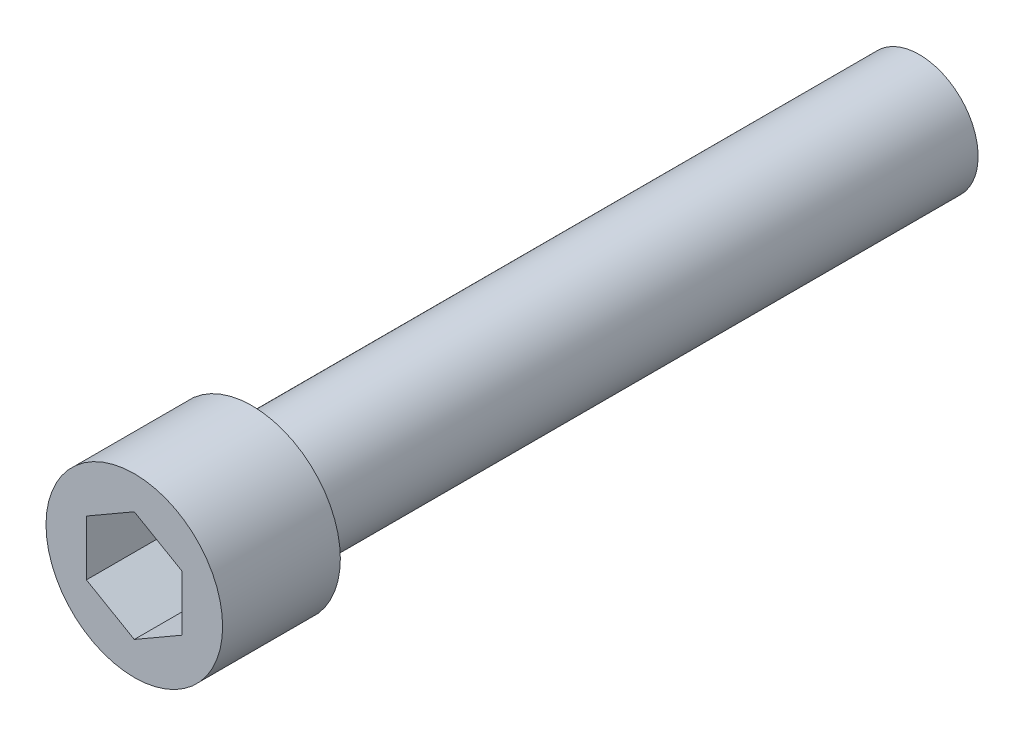
ISO-10303-21;
HEADER;
FILE_DESCRIPTION(('STEP AP214'),'2;1');
FILE_NAME('part.step','',(''),(''),'','','');
FILE_SCHEMA(('AUTOMOTIVE_DESIGN { 1 0 10303 214 1 1 1 1 }'));
ENDSEC;
DATA;
#1=APPLICATION_CONTEXT('core data for automotive mechanical design processes');
#2=APPLICATION_PROTOCOL_DEFINITION('international standard','automotive_design',2000,#1);
#3=PRODUCT_CONTEXT('',#1,'mechanical');
#4=PRODUCT('Part','Part','',(#3));
#5=PRODUCT_RELATED_PRODUCT_CATEGORY('part','',(#4));
#6=PRODUCT_DEFINITION_FORMATION('','',#4);
#7=PRODUCT_DEFINITION_CONTEXT('part definition',#1,'design');
#8=PRODUCT_DEFINITION('design','',#6,#7);
#9=PRODUCT_DEFINITION_SHAPE('','',#8);
#10=(LENGTH_UNIT() NAMED_UNIT(*) SI_UNIT(.MILLI.,.METRE.));
#11=(NAMED_UNIT(*) PLANE_ANGLE_UNIT() SI_UNIT($,.RADIAN.));
#12=(NAMED_UNIT(*) SI_UNIT($,.STERADIAN.) SOLID_ANGLE_UNIT());
#13=UNCERTAINTY_MEASURE_WITH_UNIT(LENGTH_MEASURE(1.E-05),#10,'distance_accuracy_value','');
#14=(GEOMETRIC_REPRESENTATION_CONTEXT(3) GLOBAL_UNCERTAINTY_ASSIGNED_CONTEXT((#13)) GLOBAL_UNIT_ASSIGNED_CONTEXT((#10,
#11,#12)) REPRESENTATION_CONTEXT('',''));
#15=CARTESIAN_POINT('',(0.,0.,0.));
#16=DIRECTION('',(0.,0.,1.));
#17=DIRECTION('',(1.,0.,0.));
#18=AXIS2_PLACEMENT_3D('',#15,#16,#17);
#19=CARTESIAN_POINT('',(0.,0.,4.));
#20=DIRECTION('',(0.,0.,1.));
#21=DIRECTION('',(1.,0.,0.));
#22=AXIS2_PLACEMENT_3D('',#19,#20,#21);
#23=PLANE('',#22);
#24=CARTESIAN_POINT('',(0.,0.,4.));
#25=DIRECTION('',(0.,0.,1.));
#26=DIRECTION('',(1.,0.,0.));
#27=AXIS2_PLACEMENT_3D('',#24,#25,#26);
#28=CIRCLE('',#27,4.5);
#29=CARTESIAN_POINT('',(4.5,0.,4.));
#30=VERTEX_POINT('',#29);
#31=EDGE_CURVE('E11',#30,#30,#28,.T.);
#32=ORIENTED_EDGE('',*,*,#31,.T.);
#33=EDGE_LOOP('',(#32));
#34=FACE_BOUND('',#33,.T.);
#35=DIRECTION('',(-0.866025403784438,-0.500000000000001,0.));
#36=VECTOR('',#35,1.);
#37=CARTESIAN_POINT('',(0.,2.81770361274374,4.));
#38=LINE('',#37,#36);
#39=CARTESIAN_POINT('',(0.,2.81770361274374,4.));
#40=VERTEX_POINT('',#39);
#41=CARTESIAN_POINT('',(-2.44020290897128,1.40885180637187,4.));
#42=VERTEX_POINT('',#41);
#43=EDGE_CURVE('E107',#40,#42,#38,.T.);
#44=ORIENTED_EDGE('',*,*,#43,.F.);
#45=DIRECTION('',(-0.866025403784441,0.499999999999995,0.));
#46=VECTOR('',#45,1.);
#47=CARTESIAN_POINT('',(2.44020290897126,1.4088518063719,4.));
#48=LINE('',#47,#46);
#49=CARTESIAN_POINT('',(2.44020290897126,1.4088518063719,4.));
#50=VERTEX_POINT('',#49);
#51=EDGE_CURVE('E87',#50,#40,#48,.T.);
#52=ORIENTED_EDGE('',*,*,#51,.F.);
#53=DIRECTION('',(0.,1.,0.));
#54=VECTOR('',#53,1.);
#55=CARTESIAN_POINT('',(2.44020290897129,-1.40885180637185,4.));
#56=LINE('',#55,#54);
#57=CARTESIAN_POINT('',(2.44020290897129,-1.40885180637185,4.));
#58=VERTEX_POINT('',#57);
#59=EDGE_CURVE('E58',#58,#50,#56,.T.);
#60=ORIENTED_EDGE('',*,*,#59,.F.);
#61=DIRECTION('',(0.866025403784434,0.500000000000007,0.));
#62=VECTOR('',#61,1.);
#63=CARTESIAN_POINT('',(0.,-2.81770361274374,4.));
#64=LINE('',#63,#62);
#65=CARTESIAN_POINT('',(0.,-2.81770361274374,4.));
#66=VERTEX_POINT('',#65);
#67=EDGE_CURVE('E118',#66,#58,#64,.T.);
#68=ORIENTED_EDGE('',*,*,#67,.F.);
#69=DIRECTION('',(0.866025403784442,-0.499999999999995,0.));
#70=VECTOR('',#69,1.);
#71=CARTESIAN_POINT('',(-2.44020290897127,-1.40885180637188,4.));
#72=LINE('',#71,#70);
#73=CARTESIAN_POINT('',(-2.44020290897127,-1.40885180637188,4.));
#74=VERTEX_POINT('',#73);
#75=EDGE_CURVE('E106',#74,#66,#72,.T.);
#76=ORIENTED_EDGE('',*,*,#75,.F.);
#77=DIRECTION('',(0.,-1.,0.));
#78=VECTOR('',#77,1.);
#79=CARTESIAN_POINT('',(-2.44020290897128,1.40885180637187,4.));
#80=LINE('',#79,#78);
#81=EDGE_CURVE('E96',#42,#74,#80,.T.);
#82=ORIENTED_EDGE('',*,*,#81,.F.);
#83=EDGE_LOOP('',(#44,#52,#60,#68,#76,#82));
#84=FACE_BOUND('',#83,.T.);
#85=ADVANCED_FACE('F37',(#34,#84),#23,.T.);
#86=CARTESIAN_POINT('',(0.,0.,4.));
#87=DIRECTION('',(0.,0.,-1.));
#88=DIRECTION('',(-1.,0.,0.));
#89=AXIS2_PLACEMENT_3D('',#86,#87,#88);
#90=CYLINDRICAL_SURFACE('',#89,4.5);
#91=ORIENTED_EDGE('',*,*,#31,.F.);
#92=EDGE_LOOP('',(#91));
#93=FACE_BOUND('',#92,.T.);
#94=CARTESIAN_POINT('',(0.,0.,-2.));
#95=DIRECTION('',(0.,0.,-1.));
#96=DIRECTION('',(-1.,0.,0.));
#97=AXIS2_PLACEMENT_3D('',#94,#95,#96);
#98=CIRCLE('',#97,4.5);
#99=CARTESIAN_POINT('',(-4.5,0.,-2.));
#100=VERTEX_POINT('',#99);
#101=EDGE_CURVE('E129',#100,#100,#98,.T.);
#102=ORIENTED_EDGE('',*,*,#101,.F.);
#103=EDGE_LOOP('',(#102));
#104=FACE_BOUND('',#103,.T.);
#105=ADVANCED_FACE('F39',(#93,#104),#90,.T.);
#106=CARTESIAN_POINT('',(2.44020290897126,1.4088518063719,4.));
#107=DIRECTION('',(-0.499999999999995,-0.866025403784441,0.));
#108=DIRECTION('',(0.866025403784442,-0.499999999999995,0.));
#109=AXIS2_PLACEMENT_3D('',#106,#107,#108);
#110=PLANE('',#109);
#111=DIRECTION('',(-0.866025403784441,0.499999999999995,0.));
#112=VECTOR('',#111,1.);
#113=CARTESIAN_POINT('',(2.44020290897126,1.4088518063719,0.));
#114=LINE('',#113,#112);
#115=CARTESIAN_POINT('',(2.44020290897126,1.4088518063719,0.));
#116=VERTEX_POINT('',#115);
#117=CARTESIAN_POINT('',(0.,2.81770361274374,0.));
#118=VERTEX_POINT('',#117);
#119=EDGE_CURVE('E125',#116,#118,#114,.T.);
#120=ORIENTED_EDGE('',*,*,#119,.F.);
#121=DIRECTION('',(0.,0.,-1.));
#122=VECTOR('',#121,1.);
#123=CARTESIAN_POINT('',(2.44020290897126,1.4088518063719,4.));
#124=LINE('',#123,#122);
#125=EDGE_CURVE('E124',#50,#116,#124,.T.);
#126=ORIENTED_EDGE('',*,*,#125,.F.);
#127=ORIENTED_EDGE('',*,*,#51,.T.);
#128=DIRECTION('',(0.,0.,-1.));
#129=VECTOR('',#128,1.);
#130=CARTESIAN_POINT('',(0.,2.81770361274374,4.));
#131=LINE('',#130,#129);
#132=EDGE_CURVE('E45',#40,#118,#131,.T.);
#133=ORIENTED_EDGE('',*,*,#132,.T.);
#134=EDGE_LOOP('',(#120,#126,#127,#133));
#135=FACE_BOUND('',#134,.T.);
#136=ADVANCED_FACE('F145',(#135),#110,.T.);
#137=CARTESIAN_POINT('',(0.,2.81770361274374,4.));
#138=DIRECTION('',(0.500000000000001,-0.866025403784438,0.));
#139=DIRECTION('',(0.866025403784438,0.500000000000001,0.));
#140=AXIS2_PLACEMENT_3D('',#137,#138,#139);
#141=PLANE('',#140);
#142=DIRECTION('',(-0.866025403784438,-0.500000000000001,0.));
#143=VECTOR('',#142,1.);
#144=CARTESIAN_POINT('',(0.,2.81770361274374,0.));
#145=LINE('',#144,#143);
#146=CARTESIAN_POINT('',(-2.44020290897128,1.40885180637187,0.));
#147=VERTEX_POINT('',#146);
#148=EDGE_CURVE('E128',#118,#147,#145,.T.);
#149=ORIENTED_EDGE('',*,*,#148,.F.);
#150=ORIENTED_EDGE('',*,*,#132,.F.);
#151=ORIENTED_EDGE('',*,*,#43,.T.);
#152=DIRECTION('',(0.,0.,-1.));
#153=VECTOR('',#152,1.);
#154=CARTESIAN_POINT('',(-2.44020290897128,1.40885180637187,4.));
#155=LINE('',#154,#153);
#156=EDGE_CURVE('E102',#42,#147,#155,.T.);
#157=ORIENTED_EDGE('',*,*,#156,.T.);
#158=EDGE_LOOP('',(#149,#150,#151,#157));
#159=FACE_BOUND('',#158,.T.);
#160=ADVANCED_FACE('F181',(#159),#141,.T.);
#161=CARTESIAN_POINT('',(-2.44020290897128,1.40885180637187,4.));
#162=DIRECTION('',(1.,0.,0.));
#163=DIRECTION('',(0.,1.,0.));
#164=AXIS2_PLACEMENT_3D('',#161,#162,#163);
#165=PLANE('',#164);
#166=DIRECTION('',(0.,-1.,0.));
#167=VECTOR('',#166,1.);
#168=CARTESIAN_POINT('',(-2.44020290897128,1.40885180637187,0.));
#169=LINE('',#168,#167);
#170=CARTESIAN_POINT('',(-2.44020290897127,-1.40885180637188,0.));
#171=VERTEX_POINT('',#170);
#172=EDGE_CURVE('E132',#147,#171,#169,.T.);
#173=ORIENTED_EDGE('',*,*,#172,.F.);
#174=ORIENTED_EDGE('',*,*,#156,.F.);
#175=ORIENTED_EDGE('',*,*,#81,.T.);
#176=DIRECTION('',(0.,0.,-1.));
#177=VECTOR('',#176,1.);
#178=CARTESIAN_POINT('',(-2.44020290897127,-1.40885180637188,4.));
#179=LINE('',#178,#177);
#180=EDGE_CURVE('E100',#74,#171,#179,.T.);
#181=ORIENTED_EDGE('',*,*,#180,.T.);
#182=EDGE_LOOP('',(#173,#174,#175,#181));
#183=FACE_BOUND('',#182,.T.);
#184=ADVANCED_FACE('F99',(#183),#165,.T.);
#185=CARTESIAN_POINT('',(-2.44020290897127,-1.40885180637188,4.));
#186=DIRECTION('',(0.499999999999995,0.866025403784441,0.));
#187=DIRECTION('',(-0.866025403784442,0.499999999999995,0.));
#188=AXIS2_PLACEMENT_3D('',#185,#186,#187);
#189=PLANE('',#188);
#190=DIRECTION('',(0.866025403784442,-0.499999999999995,0.));
#191=VECTOR('',#190,1.);
#192=CARTESIAN_POINT('',(-2.44020290897127,-1.40885180637188,0.));
#193=LINE('',#192,#191);
#194=CARTESIAN_POINT('',(0.,-2.81770361274374,0.));
#195=VERTEX_POINT('',#194);
#196=EDGE_CURVE('E113',#171,#195,#193,.T.);
#197=ORIENTED_EDGE('',*,*,#196,.F.);
#198=ORIENTED_EDGE('',*,*,#180,.F.);
#199=ORIENTED_EDGE('',*,*,#75,.T.);
#200=DIRECTION('',(0.,0.,-1.));
#201=VECTOR('',#200,1.);
#202=CARTESIAN_POINT('',(0.,-2.81770361274374,4.));
#203=LINE('',#202,#201);
#204=EDGE_CURVE('E115',#66,#195,#203,.T.);
#205=ORIENTED_EDGE('',*,*,#204,.T.);
#206=EDGE_LOOP('',(#197,#198,#199,#205));
#207=FACE_BOUND('',#206,.T.);
#208=ADVANCED_FACE('F110',(#207),#189,.T.);
#209=CARTESIAN_POINT('',(0.,-2.81770361274374,4.));
#210=DIRECTION('',(-0.500000000000007,0.866025403784435,0.));
#211=DIRECTION('',(-0.866025403784434,-0.500000000000007,0.));
#212=AXIS2_PLACEMENT_3D('',#209,#210,#211);
#213=PLANE('',#212);
#214=DIRECTION('',(0.866025403784434,0.500000000000007,0.));
#215=VECTOR('',#214,1.);
#216=CARTESIAN_POINT('',(0.,-2.81770361274374,0.));
#217=LINE('',#216,#215);
#218=CARTESIAN_POINT('',(2.44020290897129,-1.40885180637185,0.));
#219=VERTEX_POINT('',#218);
#220=EDGE_CURVE('E135',#195,#219,#217,.T.);
#221=ORIENTED_EDGE('',*,*,#220,.F.);
#222=ORIENTED_EDGE('',*,*,#204,.F.);
#223=ORIENTED_EDGE('',*,*,#67,.T.);
#224=DIRECTION('',(0.,0.,-1.));
#225=VECTOR('',#224,1.);
#226=CARTESIAN_POINT('',(2.44020290897129,-1.40885180637185,4.));
#227=LINE('',#226,#225);
#228=EDGE_CURVE('E52',#58,#219,#227,.T.);
#229=ORIENTED_EDGE('',*,*,#228,.T.);
#230=EDGE_LOOP('',(#221,#222,#223,#229));
#231=FACE_BOUND('',#230,.T.);
#232=ADVANCED_FACE('F194',(#231),#213,.T.);
#233=CARTESIAN_POINT('',(2.44020290897129,-1.40885180637185,4.));
#234=DIRECTION('',(-1.,0.,0.));
#235=DIRECTION('',(0.,-1.,0.));
#236=AXIS2_PLACEMENT_3D('',#233,#234,#235);
#237=PLANE('',#236);
#238=DIRECTION('',(0.,1.,0.));
#239=VECTOR('',#238,1.);
#240=CARTESIAN_POINT('',(2.44020290897129,-1.40885180637185,0.));
#241=LINE('',#240,#239);
#242=EDGE_CURVE('E138',#219,#116,#241,.T.);
#243=ORIENTED_EDGE('',*,*,#242,.F.);
#244=ORIENTED_EDGE('',*,*,#228,.F.);
#245=ORIENTED_EDGE('',*,*,#59,.T.);
#246=ORIENTED_EDGE('',*,*,#125,.T.);
#247=EDGE_LOOP('',(#243,#244,#245,#246));
#248=FACE_BOUND('',#247,.T.);
#249=ADVANCED_FACE('F149',(#248),#237,.T.);
#250=CARTESIAN_POINT('',(0.,0.,0.));
#251=DIRECTION('',(0.,0.,-1.));
#252=DIRECTION('',(-1.,0.,0.));
#253=AXIS2_PLACEMENT_3D('',#250,#251,#252);
#254=PLANE('',#253);
#255=ORIENTED_EDGE('',*,*,#119,.T.);
#256=ORIENTED_EDGE('',*,*,#148,.T.);
#257=ORIENTED_EDGE('',*,*,#172,.T.);
#258=ORIENTED_EDGE('',*,*,#196,.T.);
#259=ORIENTED_EDGE('',*,*,#220,.T.);
#260=ORIENTED_EDGE('',*,*,#242,.T.);
#261=EDGE_LOOP('',(#255,#256,#257,#258,#259,#260));
#262=FACE_BOUND('',#261,.T.);
#263=ADVANCED_FACE('F148',(#262),#254,.F.);
#264=CARTESIAN_POINT('',(0.,0.,-2.));
#265=DIRECTION('',(0.,0.,-1.));
#266=DIRECTION('',(-1.,0.,0.));
#267=AXIS2_PLACEMENT_3D('',#264,#265,#266);
#268=PLANE('',#267);
#269=CARTESIAN_POINT('',(0.,0.,-2.));
#270=DIRECTION('',(0.,0.,-1.));
#271=DIRECTION('',(-1.,0.,0.));
#272=AXIS2_PLACEMENT_3D('',#269,#270,#271);
#273=CIRCLE('',#272,3.);
#274=CARTESIAN_POINT('',(-3.,0.,-2.));
#275=VERTEX_POINT('',#274);
#276=EDGE_CURVE('E155',#275,#275,#273,.T.);
#277=ORIENTED_EDGE('',*,*,#276,.F.);
#278=EDGE_LOOP('',(#277));
#279=FACE_BOUND('',#278,.T.);
#280=ORIENTED_EDGE('',*,*,#101,.T.);
#281=EDGE_LOOP('',(#280));
#282=FACE_BOUND('',#281,.T.);
#283=ADVANCED_FACE('F166',(#279,#282),#268,.T.);
#284=CARTESIAN_POINT('',(0.,0.,-36.));
#285=DIRECTION('',(0.,0.,1.));
#286=DIRECTION('',(1.,0.,0.));
#287=AXIS2_PLACEMENT_3D('',#284,#285,#286);
#288=CYLINDRICAL_SURFACE('',#287,3.);
#289=CARTESIAN_POINT('',(0.,0.,-36.));
#290=DIRECTION('',(0.,0.,-1.));
#291=DIRECTION('',(-1.,0.,0.));
#292=AXIS2_PLACEMENT_3D('',#289,#290,#291);
#293=CIRCLE('',#292,3.);
#294=CARTESIAN_POINT('',(-3.,0.,-36.));
#295=VERTEX_POINT('',#294);
#296=EDGE_CURVE('E154',#295,#295,#293,.T.);
#297=ORIENTED_EDGE('',*,*,#296,.F.);
#298=EDGE_LOOP('',(#297));
#299=FACE_BOUND('',#298,.T.);
#300=ORIENTED_EDGE('',*,*,#276,.T.);
#301=EDGE_LOOP('',(#300));
#302=FACE_BOUND('',#301,.T.);
#303=ADVANCED_FACE('F163',(#299,#302),#288,.T.);
#304=CARTESIAN_POINT('',(0.,0.,-36.));
#305=DIRECTION('',(0.,0.,-1.));
#306=DIRECTION('',(-1.,0.,0.));
#307=AXIS2_PLACEMENT_3D('',#304,#305,#306);
#308=PLANE('',#307);
#309=ORIENTED_EDGE('',*,*,#296,.T.);
#310=EDGE_LOOP('',(#309));
#311=FACE_BOUND('',#310,.T.);
#312=ADVANCED_FACE('F161',(#311),#308,.T.);
#313=CLOSED_SHELL('',(#85,#105,#136,#160,#184,#208,#232,#249,#263,#283,#303,#312));
#314=MANIFOLD_SOLID_BREP('B2',#313);
#315=ADVANCED_BREP_SHAPE_REPRESENTATION('',(#18,#314),#14);
#316=SHAPE_DEFINITION_REPRESENTATION(#9,#315);
ENDSEC;
END-ISO-10303-21;
